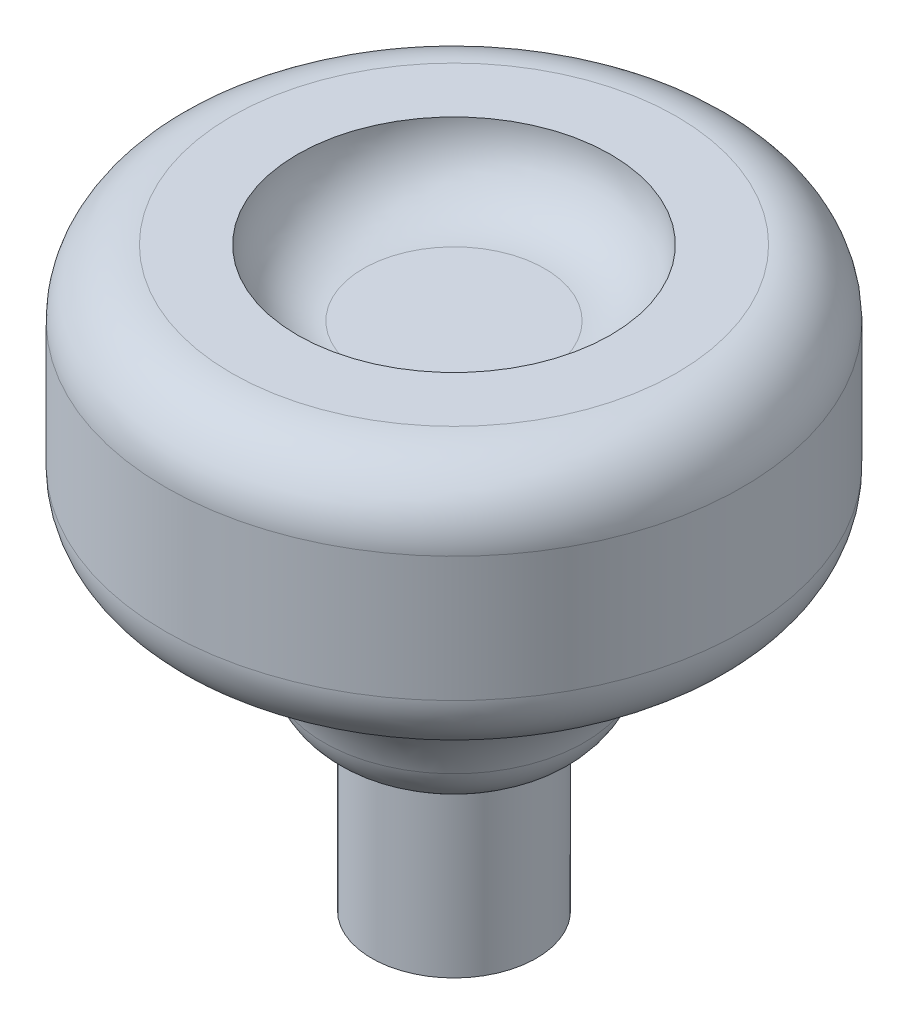
ISO-10303-21;
HEADER;
FILE_DESCRIPTION(('STEP AP214'),'2;1');
FILE_NAME('part.step','',(''),(''),'','','');
FILE_SCHEMA(('AUTOMOTIVE_DESIGN { 1 0 10303 214 1 1 1 1 }'));
ENDSEC;
DATA;
#1=APPLICATION_CONTEXT('core data for automotive mechanical design processes');
#2=APPLICATION_PROTOCOL_DEFINITION('international standard','automotive_design',2000,#1);
#3=PRODUCT_CONTEXT('',#1,'mechanical');
#4=PRODUCT('Part','Part','',(#3));
#5=PRODUCT_RELATED_PRODUCT_CATEGORY('part','',(#4));
#6=PRODUCT_DEFINITION_FORMATION('','',#4);
#7=PRODUCT_DEFINITION_CONTEXT('part definition',#1,'design');
#8=PRODUCT_DEFINITION('design','',#6,#7);
#9=PRODUCT_DEFINITION_SHAPE('','',#8);
#10=(LENGTH_UNIT() NAMED_UNIT(*) SI_UNIT(.MILLI.,.METRE.));
#11=(NAMED_UNIT(*) PLANE_ANGLE_UNIT() SI_UNIT($,.RADIAN.));
#12=(NAMED_UNIT(*) SI_UNIT($,.STERADIAN.) SOLID_ANGLE_UNIT());
#13=UNCERTAINTY_MEASURE_WITH_UNIT(LENGTH_MEASURE(1.E-05),#10,'distance_accuracy_value','');
#14=(GEOMETRIC_REPRESENTATION_CONTEXT(3) GLOBAL_UNCERTAINTY_ASSIGNED_CONTEXT((#13)) GLOBAL_UNIT_ASSIGNED_CONTEXT((#10,
#11,#12)) REPRESENTATION_CONTEXT('',''));
#15=CARTESIAN_POINT('',(0.,0.,0.));
#16=DIRECTION('',(0.,0.,1.));
#17=DIRECTION('',(1.,0.,0.));
#18=AXIS2_PLACEMENT_3D('',#15,#16,#17);
#19=CARTESIAN_POINT('',(0.,6.35,0.));
#20=DIRECTION('',(0.,-1.,0.));
#21=DIRECTION('',(0.,0.,-1.));
#22=AXIS2_PLACEMENT_3D('',#19,#20,#21);
#23=TOROIDAL_SURFACE('',#22,11.1125,6.35);
#24=CARTESIAN_POINT('',(0.,12.4352992816244,0.));
#25=DIRECTION('',(0.,-1.,0.));
#26=DIRECTION('',(0.,0.,-1.));
#27=AXIS2_PLACEMENT_3D('',#24,#25,#26);
#28=CIRCLE('',#27,9.29821428571429);
#29=CARTESIAN_POINT('',(0.,12.4352992816244,-9.29821428571429));
#30=VERTEX_POINT('',#29);
#31=EDGE_CURVE('E54',#30,#30,#28,.T.);
#32=ORIENTED_EDGE('',*,*,#31,.T.);
#33=EDGE_LOOP('',(#32));
#34=FACE_BOUND('',#33,.T.);
#35=CARTESIAN_POINT('',(0.,8.11237453417952,0.));
#36=DIRECTION('',(0.,-1.,0.));
#37=DIRECTION('',(0.,0.,-1.));
#38=AXIS2_PLACEMENT_3D('',#35,#36,#37);
#39=CIRCLE('',#38,5.01196428571429);
#40=CARTESIAN_POINT('',(0.,8.11237453417952,-5.01196428571429));
#41=VERTEX_POINT('',#40);
#42=EDGE_CURVE('E57',#41,#41,#39,.F.);
#43=ORIENTED_EDGE('',*,*,#42,.T.);
#44=EDGE_LOOP('',(#43));
#45=FACE_BOUND('',#44,.T.);
#46=ADVANCED_FACE('F34',(#34,#45),#23,.F.);
#47=CARTESIAN_POINT('',(0.,0.,0.));
#48=DIRECTION('',(0.,-1.,0.));
#49=DIRECTION('',(0.,0.,-1.));
#50=AXIS2_PLACEMENT_3D('',#47,#48,#49);
#51=CYLINDRICAL_SURFACE('',#50,11.1125);
#52=CARTESIAN_POINT('',(0.,14.8694189942742,0.));
#53=DIRECTION('',(0.,1.,0.));
#54=DIRECTION('',(0.,0.,1.));
#55=AXIS2_PLACEMENT_3D('',#52,#53,#54);
#56=CIRCLE('',#55,11.1125);
#57=CARTESIAN_POINT('',(0.,14.8694189942742,11.1125));
#58=VERTEX_POINT('',#57);
#59=EDGE_CURVE('E45',#58,#58,#56,.T.);
#60=ORIENTED_EDGE('',*,*,#59,.T.);
#61=EDGE_LOOP('',(#60));
#62=FACE_BOUND('',#61,.T.);
#63=CARTESIAN_POINT('',(0.,19.685,0.));
#64=DIRECTION('',(0.,-1.,0.));
#65=DIRECTION('',(0.,0.,-1.));
#66=AXIS2_PLACEMENT_3D('',#63,#64,#65);
#67=CIRCLE('',#66,11.1125);
#68=CARTESIAN_POINT('',(0.,19.685,-11.1125));
#69=VERTEX_POINT('',#68);
#70=EDGE_CURVE('E49',#69,#69,#67,.T.);
#71=ORIENTED_EDGE('',*,*,#70,.T.);
#72=EDGE_LOOP('',(#71));
#73=FACE_BOUND('',#72,.T.);
#74=ADVANCED_FACE('F75',(#62,#73),#51,.T.);
#75=CARTESIAN_POINT('',(0.,22.225,0.));
#76=DIRECTION('',(0.,-1.,0.));
#77=DIRECTION('',(0.,0.,-1.));
#78=AXIS2_PLACEMENT_3D('',#75,#76,#77);
#79=PLANE('',#78);
#80=CARTESIAN_POINT('',(0.,22.225,0.));
#81=DIRECTION('',(0.,1.,0.));
#82=DIRECTION('',(0.,0.,1.));
#83=AXIS2_PLACEMENT_3D('',#80,#81,#82);
#84=CIRCLE('',#83,6.03249999999998);
#85=CARTESIAN_POINT('',(0.,22.225,6.03249999999998));
#86=VERTEX_POINT('',#85);
#87=EDGE_CURVE('E66',#86,#86,#84,.T.);
#88=ORIENTED_EDGE('',*,*,#87,.F.);
#89=EDGE_LOOP('',(#88));
#90=FACE_BOUND('',#89,.T.);
#91=CARTESIAN_POINT('',(0.,22.225,0.));
#92=DIRECTION('',(0.,-1.,0.));
#93=DIRECTION('',(0.,0.,-1.));
#94=AXIS2_PLACEMENT_3D('',#91,#92,#93);
#95=CIRCLE('',#94,8.5725);
#96=CARTESIAN_POINT('',(0.,22.225,-8.5725));
#97=VERTEX_POINT('',#96);
#98=EDGE_CURVE('E41',#97,#97,#95,.F.);
#99=ORIENTED_EDGE('',*,*,#98,.T.);
#100=EDGE_LOOP('',(#99));
#101=FACE_BOUND('',#100,.T.);
#102=ADVANCED_FACE('F72',(#90,#101),#79,.F.);
#103=CARTESIAN_POINT('',(0.,0.,0.));
#104=DIRECTION('',(0.,1.,0.));
#105=DIRECTION('',(0.,0.,1.));
#106=AXIS2_PLACEMENT_3D('',#103,#104,#105);
#107=PLANE('',#106);
#108=CARTESIAN_POINT('',(0.,0.,0.));
#109=DIRECTION('',(0.,-1.,0.));
#110=DIRECTION('',(0.,0.,-1.));
#111=AXIS2_PLACEMENT_3D('',#108,#109,#110);
#112=CIRCLE('',#111,3.175);
#113=CARTESIAN_POINT('',(0.,0.,-3.175));
#114=VERTEX_POINT('',#113);
#115=EDGE_CURVE('E60',#114,#114,#112,.T.);
#116=ORIENTED_EDGE('',*,*,#115,.T.);
#117=EDGE_LOOP('',(#116));
#118=FACE_BOUND('',#117,.T.);
#119=ADVANCED_FACE('F74',(#118),#107,.F.);
#120=CARTESIAN_POINT('',(0.,0.,0.));
#121=DIRECTION('',(0.,-1.,0.));
#122=DIRECTION('',(0.,0.,-1.));
#123=AXIS2_PLACEMENT_3D('',#120,#121,#122);
#124=CYLINDRICAL_SURFACE('',#123,3.175);
#125=ORIENTED_EDGE('',*,*,#115,.F.);
#126=EDGE_LOOP('',(#125));
#127=FACE_BOUND('',#126,.T.);
#128=CARTESIAN_POINT('',(0.,6.35,0.));
#129=DIRECTION('',(0.,-1.,0.));
#130=DIRECTION('',(0.,0.,-1.));
#131=AXIS2_PLACEMENT_3D('',#128,#129,#130);
#132=CIRCLE('',#131,3.175);
#133=CARTESIAN_POINT('',(0.,6.35,-3.175));
#134=VERTEX_POINT('',#133);
#135=EDGE_CURVE('E63',#134,#134,#132,.T.);
#136=ORIENTED_EDGE('',*,*,#135,.T.);
#137=EDGE_LOOP('',(#136));
#138=FACE_BOUND('',#137,.T.);
#139=ADVANCED_FACE('F81',(#127,#138),#124,.T.);
#140=CARTESIAN_POINT('',(0.,14.8694189942742,0.));
#141=DIRECTION('',(0.,1.,0.));
#142=DIRECTION('',(0.,0.,1.));
#143=AXIS2_PLACEMENT_3D('',#140,#141,#142);
#144=TOROIDAL_SURFACE('',#143,8.5725,2.54);
#145=ORIENTED_EDGE('',*,*,#59,.F.);
#146=EDGE_LOOP('',(#145));
#147=FACE_BOUND('',#146,.T.);
#148=ORIENTED_EDGE('',*,*,#31,.F.);
#149=EDGE_LOOP('',(#148));
#150=FACE_BOUND('',#149,.T.);
#151=ADVANCED_FACE('F93',(#147,#150),#144,.T.);
#152=CARTESIAN_POINT('',(0.,8.81732434785133,0.));
#153=DIRECTION('',(0.,-1.,0.));
#154=DIRECTION('',(0.,0.,-1.));
#155=AXIS2_PLACEMENT_3D('',#152,#153,#154);
#156=TOROIDAL_SURFACE('',#155,2.57175,2.54);
#157=ORIENTED_EDGE('',*,*,#42,.F.);
#158=EDGE_LOOP('',(#157));
#159=FACE_BOUND('',#158,.T.);
#160=ORIENTED_EDGE('',*,*,#135,.F.);
#161=EDGE_LOOP('',(#160));
#162=FACE_BOUND('',#161,.T.);
#163=ADVANCED_FACE('F96',(#159,#162),#156,.T.);
#164=CARTESIAN_POINT('',(0.,19.685,0.));
#165=DIRECTION('',(0.,-1.,0.));
#166=DIRECTION('',(0.,0.,-1.));
#167=AXIS2_PLACEMENT_3D('',#164,#165,#166);
#168=TOROIDAL_SURFACE('',#167,8.5725,2.54);
#169=ORIENTED_EDGE('',*,*,#98,.F.);
#170=EDGE_LOOP('',(#169));
#171=FACE_BOUND('',#170,.T.);
#172=ORIENTED_EDGE('',*,*,#70,.F.);
#173=EDGE_LOOP('',(#172));
#174=FACE_BOUND('',#173,.T.);
#175=ADVANCED_FACE('F99',(#171,#174),#168,.T.);
#176=CARTESIAN_POINT('',(0.,19.685,0.));
#177=DIRECTION('',(0.,1.,0.));
#178=DIRECTION('',(0.,0.,1.));
#179=AXIS2_PLACEMENT_3D('',#176,#177,#178);
#180=PLANE('',#179);
#181=CARTESIAN_POINT('',(0.,19.685,0.));
#182=DIRECTION('',(0.,1.,0.));
#183=DIRECTION('',(0.,0.,1.));
#184=AXIS2_PLACEMENT_3D('',#181,#182,#183);
#185=CIRCLE('',#184,3.49249999999998);
#186=CARTESIAN_POINT('',(0.,19.685,3.49249999999998));
#187=VERTEX_POINT('',#186);
#188=EDGE_CURVE('E10',#187,#187,#185,.T.);
#189=ORIENTED_EDGE('',*,*,#188,.T.);
#190=EDGE_LOOP('',(#189));
#191=FACE_BOUND('',#190,.T.);
#192=ADVANCED_FACE('F102',(#191),#180,.T.);
#193=CARTESIAN_POINT('',(0.,22.225,0.));
#194=DIRECTION('',(0.,1.,0.));
#195=DIRECTION('',(0.,0.,1.));
#196=AXIS2_PLACEMENT_3D('',#193,#194,#195);
#197=TOROIDAL_SURFACE('',#196,3.49249999999998,2.54);
#198=ORIENTED_EDGE('',*,*,#87,.T.);
#199=EDGE_LOOP('',(#198));
#200=FACE_BOUND('',#199,.T.);
#201=ORIENTED_EDGE('',*,*,#188,.F.);
#202=EDGE_LOOP('',(#201));
#203=FACE_BOUND('',#202,.T.);
#204=ADVANCED_FACE('F36',(#200,#203),#197,.F.);
#205=CLOSED_SHELL('',(#46,#74,#102,#119,#139,#151,#163,#175,#192,#204));
#206=MANIFOLD_SOLID_BREP('B2',#205);
#207=ADVANCED_BREP_SHAPE_REPRESENTATION('',(#18,#206),#14);
#208=SHAPE_DEFINITION_REPRESENTATION(#9,#207);
ENDSEC;
END-ISO-10303-21;
